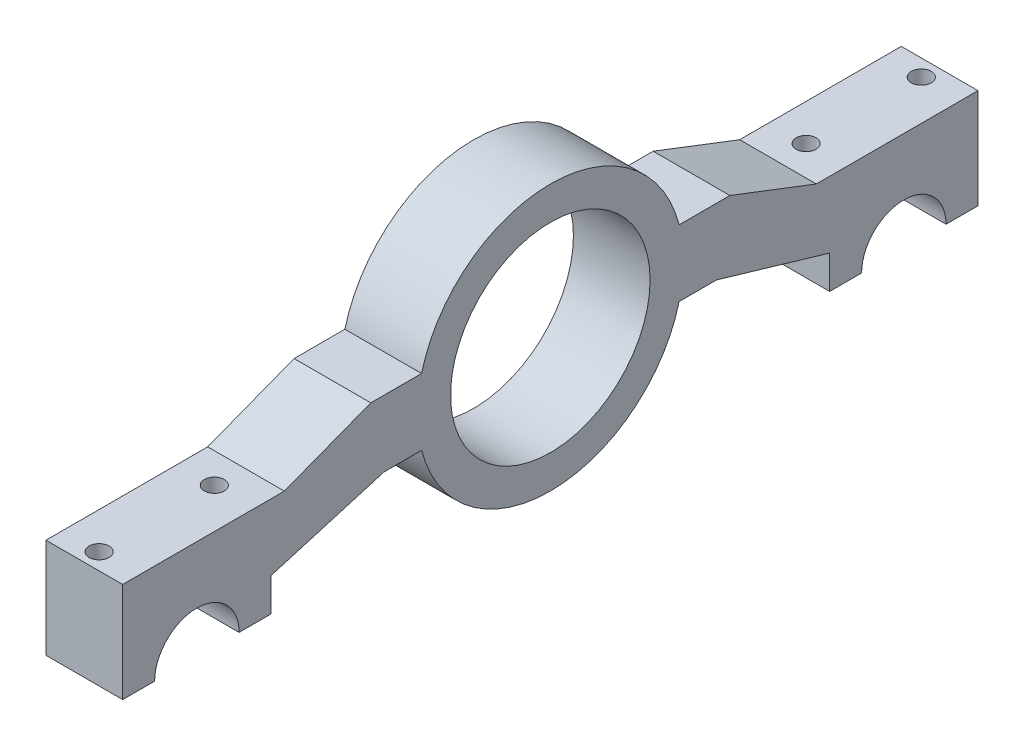
ISO-10303-21;
HEADER;
FILE_DESCRIPTION(('STEP AP214'),'2;1');
FILE_NAME('part.step','',(''),(''),'','','');
FILE_SCHEMA(('AUTOMOTIVE_DESIGN { 1 0 10303 214 1 1 1 1 }'));
ENDSEC;
DATA;
#1=APPLICATION_CONTEXT('core data for automotive mechanical design processes');
#2=APPLICATION_PROTOCOL_DEFINITION('international standard','automotive_design',2000,#1);
#3=PRODUCT_CONTEXT('',#1,'mechanical');
#4=PRODUCT('Part','Part','',(#3));
#5=PRODUCT_RELATED_PRODUCT_CATEGORY('part','',(#4));
#6=PRODUCT_DEFINITION_FORMATION('','',#4);
#7=PRODUCT_DEFINITION_CONTEXT('part definition',#1,'design');
#8=PRODUCT_DEFINITION('design','',#6,#7);
#9=PRODUCT_DEFINITION_SHAPE('','',#8);
#10=(LENGTH_UNIT() NAMED_UNIT(*) SI_UNIT(.MILLI.,.METRE.));
#11=(NAMED_UNIT(*) PLANE_ANGLE_UNIT() SI_UNIT($,.RADIAN.));
#12=(NAMED_UNIT(*) SI_UNIT($,.STERADIAN.) SOLID_ANGLE_UNIT());
#13=UNCERTAINTY_MEASURE_WITH_UNIT(LENGTH_MEASURE(1.E-05),#10,'distance_accuracy_value','');
#14=(GEOMETRIC_REPRESENTATION_CONTEXT(3) GLOBAL_UNCERTAINTY_ASSIGNED_CONTEXT((#13)) GLOBAL_UNIT_ASSIGNED_CONTEXT((#10,
#11,#12)) REPRESENTATION_CONTEXT('',''));
#15=CARTESIAN_POINT('',(0.,0.,0.));
#16=DIRECTION('',(0.,0.,1.));
#17=DIRECTION('',(1.,0.,0.));
#18=AXIS2_PLACEMENT_3D('',#15,#16,#17);
#19=CARTESIAN_POINT('',(-5.765,10.,-48.155));
#20=DIRECTION('',(0.,1.,0.));
#21=DIRECTION('',(-1.,0.,0.));
#22=AXIS2_PLACEMENT_3D('',#19,#20,#21);
#23=PLANE('',#22);
#24=DIRECTION('',(0.,0.,1.));
#25=VECTOR('',#24,1.);
#26=CARTESIAN_POINT('',(-5.765,10.,-48.155));
#27=LINE('',#26,#25);
#28=CARTESIAN_POINT('',(-5.765,10.,24.3649167310371));
#29=VERTEX_POINT('',#28);
#30=CARTESIAN_POINT('',(-5.765,10.,30.));
#31=VERTEX_POINT('',#30);
#32=EDGE_CURVE('E351',#29,#31,#27,.T.);
#33=ORIENTED_EDGE('',*,*,#32,.F.);
#34=DIRECTION('',(1.,0.,0.));
#35=VECTOR('',#34,1.);
#36=CARTESIAN_POINT('',(-5.765,10.,24.3649167310371));
#37=LINE('',#36,#35);
#38=CARTESIAN_POINT('',(5.765,10.,24.3649167310371));
#39=VERTEX_POINT('',#38);
#40=EDGE_CURVE('E57',#29,#39,#37,.T.);
#41=ORIENTED_EDGE('',*,*,#40,.T.);
#42=DIRECTION('',(0.,0.,1.));
#43=VECTOR('',#42,1.);
#44=CARTESIAN_POINT('',(5.765,10.,-48.155));
#45=LINE('',#44,#43);
#46=CARTESIAN_POINT('',(5.765,10.,30.));
#47=VERTEX_POINT('',#46);
#48=EDGE_CURVE('E223',#39,#47,#45,.T.);
#49=ORIENTED_EDGE('',*,*,#48,.T.);
#50=DIRECTION('',(1.,0.,0.));
#51=VECTOR('',#50,1.);
#52=CARTESIAN_POINT('',(-5.765,10.,30.));
#53=LINE('',#52,#51);
#54=EDGE_CURVE('E368',#31,#47,#53,.T.);
#55=ORIENTED_EDGE('',*,*,#54,.F.);
#56=EDGE_LOOP('',(#33,#41,#49,#55));
#57=FACE_BOUND('',#56,.T.);
#58=ADVANCED_FACE('F41',(#57),#23,.F.);
#59=CARTESIAN_POINT('',(0.,20.,0.));
#60=DIRECTION('',(0.,1.,0.));
#61=DIRECTION('',(0.,0.,1.));
#62=AXIS2_PLACEMENT_3D('',#59,#60,#61);
#63=PLANE('',#62);
#64=DIRECTION('',(1.,0.,0.));
#65=VECTOR('',#64,1.);
#66=CARTESIAN_POINT('',(-5.765,20.,24.3649167310371));
#67=LINE('',#66,#65);
#68=CARTESIAN_POINT('',(-5.765,20.,24.3649167310371));
#69=VERTEX_POINT('',#68);
#70=CARTESIAN_POINT('',(5.765,20.,24.3649167310371));
#71=VERTEX_POINT('',#70);
#72=EDGE_CURVE('E11',#69,#71,#67,.T.);
#73=ORIENTED_EDGE('',*,*,#72,.F.);
#74=DIRECTION('',(0.,0.,1.));
#75=VECTOR('',#74,1.);
#76=CARTESIAN_POINT('',(-5.765,20.,0.));
#77=LINE('',#76,#75);
#78=CARTESIAN_POINT('',(-5.765,20.,32.));
#79=VERTEX_POINT('',#78);
#80=EDGE_CURVE('E222',#69,#79,#77,.T.);
#81=ORIENTED_EDGE('',*,*,#80,.T.);
#82=DIRECTION('',(1.,0.,0.));
#83=VECTOR('',#82,1.);
#84=CARTESIAN_POINT('',(-5.765,20.,32.));
#85=LINE('',#84,#83);
#86=CARTESIAN_POINT('',(5.765,20.,32.));
#87=VERTEX_POINT('',#86);
#88=EDGE_CURVE('E241',#79,#87,#85,.T.);
#89=ORIENTED_EDGE('',*,*,#88,.T.);
#90=DIRECTION('',(0.,0.,-1.));
#91=VECTOR('',#90,1.);
#92=CARTESIAN_POINT('',(5.765,20.,0.));
#93=LINE('',#92,#91);
#94=EDGE_CURVE('E218',#87,#71,#93,.T.);
#95=ORIENTED_EDGE('',*,*,#94,.T.);
#96=EDGE_LOOP('',(#73,#81,#89,#95));
#97=FACE_BOUND('',#96,.T.);
#98=ADVANCED_FACE('F493',(#97),#63,.T.);
#99=CARTESIAN_POINT('',(5.765,0.,-59.31));
#100=DIRECTION('',(0.,0.,1.));
#101=DIRECTION('',(1.,0.,0.));
#102=AXIS2_PLACEMENT_3D('',#99,#100,#101);
#103=PLANE('',#102);
#104=DIRECTION('',(1.,0.,0.));
#105=VECTOR('',#104,1.);
#106=CARTESIAN_POINT('',(-5.765,15.,-59.31));
#107=LINE('',#106,#105);
#108=CARTESIAN_POINT('',(-5.765,15.,-59.31));
#109=VERTEX_POINT('',#108);
#110=CARTESIAN_POINT('',(5.765,15.,-59.31));
#111=VERTEX_POINT('',#110);
#112=EDGE_CURVE('E404',#109,#111,#107,.T.);
#113=ORIENTED_EDGE('',*,*,#112,.T.);
#114=DIRECTION('',(0.,1.,0.));
#115=VECTOR('',#114,1.);
#116=CARTESIAN_POINT('',(5.765,0.,-59.31));
#117=LINE('',#116,#115);
#118=CARTESIAN_POINT('',(5.765,0.,-59.31));
#119=VERTEX_POINT('',#118);
#120=EDGE_CURVE('E331',#119,#111,#117,.T.);
#121=ORIENTED_EDGE('',*,*,#120,.F.);
#122=DIRECTION('',(-1.,0.,0.));
#123=VECTOR('',#122,1.);
#124=CARTESIAN_POINT('',(5.765,0.,-59.31));
#125=LINE('',#124,#123);
#126=CARTESIAN_POINT('',(-5.765,0.,-59.31));
#127=VERTEX_POINT('',#126);
#128=EDGE_CURVE('E348',#119,#127,#125,.T.);
#129=ORIENTED_EDGE('',*,*,#128,.T.);
#130=DIRECTION('',(0.,1.,0.));
#131=VECTOR('',#130,1.);
#132=CARTESIAN_POINT('',(-5.765,0.,-59.31));
#133=LINE('',#132,#131);
#134=EDGE_CURVE('E327',#127,#109,#133,.T.);
#135=ORIENTED_EDGE('',*,*,#134,.T.);
#136=EDGE_LOOP('',(#113,#121,#129,#135));
#137=FACE_BOUND('',#136,.T.);
#138=ADVANCED_FACE('F491',(#137),#103,.F.);
#139=CARTESIAN_POINT('',(-5.765,10.,10.));
#140=DIRECTION('',(1.,0.,0.));
#141=DIRECTION('',(0.,0.,-1.));
#142=AXIS2_PLACEMENT_3D('',#139,#140,#141);
#143=PLANE('',#142);
#144=CARTESIAN_POINT('',(-5.765,10.,-20.));
#145=VERTEX_POINT('',#144);
#146=CARTESIAN_POINT('',(-5.765,10.,-14.3649167310371));
#147=VERTEX_POINT('',#146);
#148=EDGE_CURVE('E352',#145,#147,#27,.T.);
#149=ORIENTED_EDGE('',*,*,#148,.T.);
#150=CARTESIAN_POINT('',(-5.765,15.,5.));
#151=DIRECTION('',(1.,0.,0.));
#152=DIRECTION('',(0.,0.,-1.));
#153=AXIS2_PLACEMENT_3D('',#150,#151,#152);
#154=CIRCLE('',#153,20.);
#155=EDGE_CURVE('E199',#29,#147,#154,.T.);
#156=ORIENTED_EDGE('',*,*,#155,.F.);
#157=ORIENTED_EDGE('',*,*,#32,.T.);
#158=DIRECTION('',(0.,0.28216632399155,-0.959365501571271));
#159=VECTOR('',#158,1.);
#160=CARTESIAN_POINT('',(-5.765,17.3248407643312,5.09554140127388));
#161=LINE('',#160,#159);
#162=CARTESIAN_POINT('',(-5.765,4.99999999999999,47.));
#163=VERTEX_POINT('',#162);
#164=EDGE_CURVE('E366',#163,#31,#161,.T.);
#165=ORIENTED_EDGE('',*,*,#164,.F.);
#166=DIRECTION('',(0.,-1.,0.));
#167=VECTOR('',#166,1.);
#168=CARTESIAN_POINT('',(-5.765,0.,47.));
#169=LINE('',#168,#167);
#170=CARTESIAN_POINT('',(-5.765,0.,47.));
#171=VERTEX_POINT('',#170);
#172=EDGE_CURVE('E307',#163,#171,#169,.T.);
#173=ORIENTED_EDGE('',*,*,#172,.T.);
#174=DIRECTION('',(0.,0.,-1.));
#175=VECTOR('',#174,1.);
#176=CARTESIAN_POINT('',(-5.765,0.,-41.805));
#177=LINE('',#176,#175);
#178=CARTESIAN_POINT('',(-5.765,0.,51.805));
#179=VERTEX_POINT('',#178);
#180=EDGE_CURVE('E287',#179,#171,#177,.T.);
#181=ORIENTED_EDGE('',*,*,#180,.F.);
#182=CARTESIAN_POINT('',(-5.765,0.,58.155));
#183=DIRECTION('',(-1.,0.,0.));
#184=DIRECTION('',(0.,0.,1.));
#185=AXIS2_PLACEMENT_3D('',#182,#183,#184);
#186=CIRCLE('',#185,6.35);
#187=CARTESIAN_POINT('',(-5.765,0.,64.505));
#188=VERTEX_POINT('',#187);
#189=EDGE_CURVE('E313',#188,#179,#186,.T.);
#190=ORIENTED_EDGE('',*,*,#189,.F.);
#191=CARTESIAN_POINT('',(-5.765,0.,69.31));
#192=VERTEX_POINT('',#191);
#193=EDGE_CURVE('E284',#192,#188,#177,.T.);
#194=ORIENTED_EDGE('',*,*,#193,.F.);
#195=DIRECTION('',(0.,1.,0.));
#196=VECTOR('',#195,1.);
#197=CARTESIAN_POINT('',(-5.765,0.,69.31));
#198=LINE('',#197,#196);
#199=CARTESIAN_POINT('',(-5.765,15.,69.31));
#200=VERTEX_POINT('',#199);
#201=EDGE_CURVE('E303',#192,#200,#198,.T.);
#202=ORIENTED_EDGE('',*,*,#201,.T.);
#203=DIRECTION('',(0.,0.,-1.));
#204=VECTOR('',#203,1.);
#205=CARTESIAN_POINT('',(-5.765,15.,0.));
#206=LINE('',#205,#204);
#207=CARTESIAN_POINT('',(-5.765,15.,45.));
#208=VERTEX_POINT('',#207);
#209=EDGE_CURVE('E390',#200,#208,#206,.T.);
#210=ORIENTED_EDGE('',*,*,#209,.T.);
#211=DIRECTION('',(0.,0.358979079308869,-0.93334560620306));
#212=VECTOR('',#211,1.);
#213=CARTESIAN_POINT('',(-5.765,28.1443298969072,10.8247422680412));
#214=LINE('',#213,#212);
#215=EDGE_CURVE('E394',#208,#79,#214,.T.);
#216=ORIENTED_EDGE('',*,*,#215,.T.);
#217=ORIENTED_EDGE('',*,*,#80,.F.);
#218=CARTESIAN_POINT('',(-5.765,20.,-14.3649167310371));
#219=VERTEX_POINT('',#218);
#220=EDGE_CURVE('E438',#219,#69,#154,.T.);
#221=ORIENTED_EDGE('',*,*,#220,.F.);
#222=CARTESIAN_POINT('',(-5.765,20.,-22.));
#223=VERTEX_POINT('',#222);
#224=EDGE_CURVE('E209',#223,#219,#77,.T.);
#225=ORIENTED_EDGE('',*,*,#224,.F.);
#226=DIRECTION('',(0.,-0.358979079308869,-0.93334560620306));
#227=VECTOR('',#226,1.);
#228=CARTESIAN_POINT('',(-5.765,24.7938144329897,-9.53608247422681));
#229=LINE('',#228,#227);
#230=CARTESIAN_POINT('',(-5.765,15.,-35.));
#231=VERTEX_POINT('',#230);
#232=EDGE_CURVE('E415',#223,#231,#229,.T.);
#233=ORIENTED_EDGE('',*,*,#232,.T.);
#234=DIRECTION('',(0.,0.,1.));
#235=VECTOR('',#234,1.);
#236=CARTESIAN_POINT('',(-5.765,15.,0.));
#237=LINE('',#236,#235);
#238=EDGE_CURVE('E419',#109,#231,#237,.T.);
#239=ORIENTED_EDGE('',*,*,#238,.F.);
#240=ORIENTED_EDGE('',*,*,#134,.F.);
#241=CARTESIAN_POINT('',(-5.765,0.,-54.505));
#242=VERTEX_POINT('',#241);
#243=EDGE_CURVE('E265',#242,#127,#177,.T.);
#244=ORIENTED_EDGE('',*,*,#243,.F.);
#245=CARTESIAN_POINT('',(-5.765,0.,-48.155));
#246=DIRECTION('',(1.,0.,0.));
#247=DIRECTION('',(0.,0.,-1.));
#248=AXIS2_PLACEMENT_3D('',#245,#246,#247);
#249=CIRCLE('',#248,6.35);
#250=CARTESIAN_POINT('',(-5.765,0.,-41.805));
#251=VERTEX_POINT('',#250);
#252=EDGE_CURVE('E319',#242,#251,#249,.T.);
#253=ORIENTED_EDGE('',*,*,#252,.T.);
#254=CARTESIAN_POINT('',(-5.765,0.,-37.));
#255=VERTEX_POINT('',#254);
#256=EDGE_CURVE('E544',#255,#251,#177,.T.);
#257=ORIENTED_EDGE('',*,*,#256,.F.);
#258=DIRECTION('',(0.,-1.,0.));
#259=VECTOR('',#258,1.);
#260=CARTESIAN_POINT('',(-5.765,0.,-37.));
#261=LINE('',#260,#259);
#262=CARTESIAN_POINT('',(-5.765,5.,-37.));
#263=VERTEX_POINT('',#262);
#264=EDGE_CURVE('E336',#263,#255,#261,.T.);
#265=ORIENTED_EDGE('',*,*,#264,.F.);
#266=DIRECTION('',(0.,-0.282166323991551,-0.95936550157127));
#267=VECTOR('',#266,1.);
#268=CARTESIAN_POINT('',(-5.765,14.6178343949045,-4.29936305732485));
#269=LINE('',#268,#267);
#270=EDGE_CURVE('E452',#145,#263,#269,.T.);
#271=ORIENTED_EDGE('',*,*,#270,.F.);
#272=EDGE_LOOP('',(#149,#156,#157,#165,#173,#181,#190,#194,#202,#210,#216,#217,#221,#225,#233,
#239,#240,#244,#253,#257,#265,#271));
#273=FACE_BOUND('',#272,.T.);
#274=CARTESIAN_POINT('',(-5.765,15.,5.));
#275=DIRECTION('',(1.,0.,0.));
#276=DIRECTION('',(0.,0.,-1.));
#277=AXIS2_PLACEMENT_3D('',#274,#275,#276);
#278=CIRCLE('',#277,15.);
#279=CARTESIAN_POINT('',(-5.765,15.,-10.));
#280=VERTEX_POINT('',#279);
#281=EDGE_CURVE('E472',#280,#280,#278,.T.);
#282=ORIENTED_EDGE('',*,*,#281,.T.);
#283=EDGE_LOOP('',(#282));
#284=FACE_BOUND('',#283,.T.);
#285=ADVANCED_FACE('F363',(#273,#284),#143,.F.);
#286=CARTESIAN_POINT('',(5.765,10.,10.));
#287=DIRECTION('',(-1.,0.,0.));
#288=DIRECTION('',(0.,0.,1.));
#289=AXIS2_PLACEMENT_3D('',#286,#287,#288);
#290=PLANE('',#289);
#291=ORIENTED_EDGE('',*,*,#48,.F.);
#292=CARTESIAN_POINT('',(5.765,15.,5.));
#293=DIRECTION('',(1.,0.,0.));
#294=DIRECTION('',(0.,0.,-1.));
#295=AXIS2_PLACEMENT_3D('',#292,#293,#294);
#296=CIRCLE('',#295,20.);
#297=CARTESIAN_POINT('',(5.765,10.,-14.3649167310371));
#298=VERTEX_POINT('',#297);
#299=EDGE_CURVE('E200',#39,#298,#296,.T.);
#300=ORIENTED_EDGE('',*,*,#299,.T.);
#301=CARTESIAN_POINT('',(5.765,10.,-20.));
#302=VERTEX_POINT('',#301);
#303=EDGE_CURVE('E65',#302,#298,#45,.T.);
#304=ORIENTED_EDGE('',*,*,#303,.F.);
#305=DIRECTION('',(0.,-0.282166323991551,-0.95936550157127));
#306=VECTOR('',#305,1.);
#307=CARTESIAN_POINT('',(5.765,14.6178343949045,-4.29936305732485));
#308=LINE('',#307,#306);
#309=CARTESIAN_POINT('',(5.765,5.,-37.));
#310=VERTEX_POINT('',#309);
#311=EDGE_CURVE('E451',#302,#310,#308,.T.);
#312=ORIENTED_EDGE('',*,*,#311,.T.);
#313=DIRECTION('',(0.,-1.,0.));
#314=VECTOR('',#313,1.);
#315=CARTESIAN_POINT('',(5.765,0.,-37.));
#316=LINE('',#315,#314);
#317=CARTESIAN_POINT('',(5.765,0.,-37.));
#318=VERTEX_POINT('',#317);
#319=EDGE_CURVE('E335',#310,#318,#316,.T.);
#320=ORIENTED_EDGE('',*,*,#319,.T.);
#321=DIRECTION('',(0.,0.,-1.));
#322=VECTOR('',#321,1.);
#323=CARTESIAN_POINT('',(5.765,0.,-59.31));
#324=LINE('',#323,#322);
#325=CARTESIAN_POINT('',(5.765,0.,-41.805));
#326=VERTEX_POINT('',#325);
#327=EDGE_CURVE('E528',#318,#326,#324,.T.);
#328=ORIENTED_EDGE('',*,*,#327,.T.);
#329=CARTESIAN_POINT('',(5.765,0.,-48.155));
#330=DIRECTION('',(1.,0.,0.));
#331=DIRECTION('',(0.,0.,-1.));
#332=AXIS2_PLACEMENT_3D('',#329,#330,#331);
#333=CIRCLE('',#332,6.35);
#334=CARTESIAN_POINT('',(5.765,0.,-54.505));
#335=VERTEX_POINT('',#334);
#336=EDGE_CURVE('E323',#335,#326,#333,.T.);
#337=ORIENTED_EDGE('',*,*,#336,.F.);
#338=EDGE_CURVE('E283',#335,#119,#324,.T.);
#339=ORIENTED_EDGE('',*,*,#338,.T.);
#340=ORIENTED_EDGE('',*,*,#120,.T.);
#341=DIRECTION('',(0.,0.,1.));
#342=VECTOR('',#341,1.);
#343=CARTESIAN_POINT('',(5.765,15.,0.));
#344=LINE('',#343,#342);
#345=CARTESIAN_POINT('',(5.765,15.,-35.));
#346=VERTEX_POINT('',#345);
#347=EDGE_CURVE('E420',#111,#346,#344,.T.);
#348=ORIENTED_EDGE('',*,*,#347,.T.);
#349=DIRECTION('',(0.,-0.358979079308869,-0.93334560620306));
#350=VECTOR('',#349,1.);
#351=CARTESIAN_POINT('',(5.765,24.7938144329897,-9.53608247422681));
#352=LINE('',#351,#350);
#353=CARTESIAN_POINT('',(5.765,20.,-22.));
#354=VERTEX_POINT('',#353);
#355=EDGE_CURVE('E216',#354,#346,#352,.T.);
#356=ORIENTED_EDGE('',*,*,#355,.F.);
#357=CARTESIAN_POINT('',(5.765,20.,-14.3649167310371));
#358=VERTEX_POINT('',#357);
#359=EDGE_CURVE('E206',#358,#354,#93,.T.);
#360=ORIENTED_EDGE('',*,*,#359,.F.);
#361=EDGE_CURVE('E189',#358,#71,#296,.T.);
#362=ORIENTED_EDGE('',*,*,#361,.T.);
#363=ORIENTED_EDGE('',*,*,#94,.F.);
#364=DIRECTION('',(0.,0.358979079308869,-0.93334560620306));
#365=VECTOR('',#364,1.);
#366=CARTESIAN_POINT('',(5.765,28.1443298969072,10.8247422680412));
#367=LINE('',#366,#365);
#368=CARTESIAN_POINT('',(5.765,15.,45.));
#369=VERTEX_POINT('',#368);
#370=EDGE_CURVE('E395',#369,#87,#367,.T.);
#371=ORIENTED_EDGE('',*,*,#370,.F.);
#372=DIRECTION('',(0.,0.,-1.));
#373=VECTOR('',#372,1.);
#374=CARTESIAN_POINT('',(5.765,15.,0.));
#375=LINE('',#374,#373);
#376=CARTESIAN_POINT('',(5.765,15.,69.31));
#377=VERTEX_POINT('',#376);
#378=EDGE_CURVE('E400',#377,#369,#375,.T.);
#379=ORIENTED_EDGE('',*,*,#378,.F.);
#380=DIRECTION('',(0.,1.,0.));
#381=VECTOR('',#380,1.);
#382=CARTESIAN_POINT('',(5.765,0.,69.31));
#383=LINE('',#382,#381);
#384=CARTESIAN_POINT('',(5.765,0.,69.31));
#385=VERTEX_POINT('',#384);
#386=EDGE_CURVE('E298',#385,#377,#383,.T.);
#387=ORIENTED_EDGE('',*,*,#386,.F.);
#388=CARTESIAN_POINT('',(5.765,0.,64.505));
#389=VERTEX_POINT('',#388);
#390=EDGE_CURVE('E277',#385,#389,#324,.T.);
#391=ORIENTED_EDGE('',*,*,#390,.T.);
#392=CARTESIAN_POINT('',(5.765,0.,58.155));
#393=DIRECTION('',(-1.,0.,0.));
#394=DIRECTION('',(0.,0.,1.));
#395=AXIS2_PLACEMENT_3D('',#392,#393,#394);
#396=CIRCLE('',#395,6.35);
#397=CARTESIAN_POINT('',(5.765,0.,51.805));
#398=VERTEX_POINT('',#397);
#399=EDGE_CURVE('E293',#389,#398,#396,.T.);
#400=ORIENTED_EDGE('',*,*,#399,.T.);
#401=CARTESIAN_POINT('',(5.765,0.,47.));
#402=VERTEX_POINT('',#401);
#403=EDGE_CURVE('E282',#398,#402,#324,.T.);
#404=ORIENTED_EDGE('',*,*,#403,.T.);
#405=DIRECTION('',(0.,-1.,0.));
#406=VECTOR('',#405,1.);
#407=CARTESIAN_POINT('',(5.765,0.,47.));
#408=LINE('',#407,#406);
#409=CARTESIAN_POINT('',(5.765,4.99999999999999,47.));
#410=VERTEX_POINT('',#409);
#411=EDGE_CURVE('E299',#410,#402,#408,.T.);
#412=ORIENTED_EDGE('',*,*,#411,.F.);
#413=DIRECTION('',(0.,0.28216632399155,-0.959365501571271));
#414=VECTOR('',#413,1.);
#415=CARTESIAN_POINT('',(5.765,17.3248407643312,5.09554140127388));
#416=LINE('',#415,#414);
#417=EDGE_CURVE('E379',#410,#47,#416,.T.);
#418=ORIENTED_EDGE('',*,*,#417,.T.);
#419=EDGE_LOOP('',(#291,#300,#304,#312,#320,#328,#337,#339,#340,#348,#356,#360,#362,#363,#371,
#379,#387,#391,#400,#404,#412,#418));
#420=FACE_BOUND('',#419,.T.);
#421=CARTESIAN_POINT('',(5.765,15.,5.));
#422=DIRECTION('',(1.,0.,0.));
#423=DIRECTION('',(0.,0.,-1.));
#424=AXIS2_PLACEMENT_3D('',#421,#422,#423);
#425=CIRCLE('',#424,15.);
#426=CARTESIAN_POINT('',(5.765,15.,-10.));
#427=VERTEX_POINT('',#426);
#428=EDGE_CURVE('E446',#427,#427,#425,.T.);
#429=ORIENTED_EDGE('',*,*,#428,.F.);
#430=EDGE_LOOP('',(#429));
#431=FACE_BOUND('',#430,.T.);
#432=ADVANCED_FACE('F43',(#420,#431),#290,.F.);
#433=CARTESIAN_POINT('',(-0.265,20.,-39.5));
#434=DIRECTION('',(0.,-1.,0.));
#435=DIRECTION('',(0.,0.,-1.));
#436=AXIS2_PLACEMENT_3D('',#433,#434,#435);
#437=CYLINDRICAL_SURFACE('',#436,1.5);
#438=CARTESIAN_POINT('',(-0.265,0.,-39.5));
#439=DIRECTION('',(0.,-1.,0.));
#440=DIRECTION('',(0.,0.,-1.));
#441=AXIS2_PLACEMENT_3D('',#438,#439,#440);
#442=CIRCLE('',#441,1.5);
#443=CARTESIAN_POINT('',(-0.265,0.,-41.));
#444=VERTEX_POINT('',#443);
#445=EDGE_CURVE('E266',#444,#444,#442,.T.);
#446=ORIENTED_EDGE('',*,*,#445,.T.);
#447=EDGE_LOOP('',(#446));
#448=FACE_BOUND('',#447,.T.);
#449=CARTESIAN_POINT('',(-0.265,15.,-39.5));
#450=DIRECTION('',(0.,1.,0.));
#451=DIRECTION('',(0.,0.,1.));
#452=AXIS2_PLACEMENT_3D('',#449,#450,#451);
#453=CIRCLE('',#452,1.5);
#454=CARTESIAN_POINT('',(-0.265,15.,-38.));
#455=VERTEX_POINT('',#454);
#456=EDGE_CURVE('E245',#455,#455,#453,.F.);
#457=ORIENTED_EDGE('',*,*,#456,.F.);
#458=EDGE_LOOP('',(#457));
#459=FACE_BOUND('',#458,.T.);
#460=ADVANCED_FACE('F483',(#448,#459),#437,.F.);
#461=CARTESIAN_POINT('',(-0.265,20.,-56.81));
#462=DIRECTION('',(0.,-1.,0.));
#463=DIRECTION('',(0.,0.,-1.));
#464=AXIS2_PLACEMENT_3D('',#461,#462,#463);
#465=CYLINDRICAL_SURFACE('',#464,1.5);
#466=CARTESIAN_POINT('',(-0.265,0.,-56.81));
#467=DIRECTION('',(0.,-1.,0.));
#468=DIRECTION('',(0.,0.,-1.));
#469=AXIS2_PLACEMENT_3D('',#466,#467,#468);
#470=CIRCLE('',#469,1.5);
#471=CARTESIAN_POINT('',(-0.265,0.,-58.31));
#472=VERTEX_POINT('',#471);
#473=EDGE_CURVE('E261',#472,#472,#470,.T.);
#474=ORIENTED_EDGE('',*,*,#473,.T.);
#475=EDGE_LOOP('',(#474));
#476=FACE_BOUND('',#475,.T.);
#477=CARTESIAN_POINT('',(-0.265,15.,-56.81));
#478=DIRECTION('',(0.,1.,0.));
#479=DIRECTION('',(0.,0.,1.));
#480=AXIS2_PLACEMENT_3D('',#477,#478,#479);
#481=CIRCLE('',#480,1.5);
#482=CARTESIAN_POINT('',(-0.265,15.,-55.31));
#483=VERTEX_POINT('',#482);
#484=EDGE_CURVE('E242',#483,#483,#481,.F.);
#485=ORIENTED_EDGE('',*,*,#484,.F.);
#486=EDGE_LOOP('',(#485));
#487=FACE_BOUND('',#486,.T.);
#488=ADVANCED_FACE('F488',(#476,#487),#465,.F.);
#489=CARTESIAN_POINT('',(5.765,0.,-48.155));
#490=DIRECTION('',(-1.,0.,0.));
#491=DIRECTION('',(0.,0.,1.));
#492=AXIS2_PLACEMENT_3D('',#489,#490,#491);
#493=CYLINDRICAL_SURFACE('',#492,6.35);
#494=DIRECTION('',(-1.,0.,0.));
#495=VECTOR('',#494,1.);
#496=CARTESIAN_POINT('',(5.765,0.,-54.505));
#497=LINE('',#496,#495);
#498=EDGE_CURVE('E290',#335,#242,#497,.T.);
#499=ORIENTED_EDGE('',*,*,#498,.F.);
#500=ORIENTED_EDGE('',*,*,#336,.T.);
#501=DIRECTION('',(-1.,0.,0.));
#502=VECTOR('',#501,1.);
#503=CARTESIAN_POINT('',(5.765,0.,-41.805));
#504=LINE('',#503,#502);
#505=EDGE_CURVE('E281',#251,#326,#504,.F.);
#506=ORIENTED_EDGE('',*,*,#505,.F.);
#507=ORIENTED_EDGE('',*,*,#252,.F.);
#508=EDGE_LOOP('',(#499,#500,#506,#507));
#509=FACE_BOUND('',#508,.T.);
#510=ADVANCED_FACE('F508',(#509),#493,.F.);
#511=CARTESIAN_POINT('',(5.765,0.,-37.));
#512=DIRECTION('',(0.,0.,-1.));
#513=DIRECTION('',(-1.,0.,0.));
#514=AXIS2_PLACEMENT_3D('',#511,#512,#513);
#515=PLANE('',#514);
#516=ORIENTED_EDGE('',*,*,#319,.F.);
#517=DIRECTION('',(1.,0.,0.));
#518=VECTOR('',#517,1.);
#519=CARTESIAN_POINT('',(-5.765,5.,-37.));
#520=LINE('',#519,#518);
#521=EDGE_CURVE('E384',#263,#310,#520,.T.);
#522=ORIENTED_EDGE('',*,*,#521,.F.);
#523=ORIENTED_EDGE('',*,*,#264,.T.);
#524=DIRECTION('',(-1.,0.,0.));
#525=VECTOR('',#524,1.);
#526=CARTESIAN_POINT('',(5.765,0.,-37.));
#527=LINE('',#526,#525);
#528=EDGE_CURVE('E339',#318,#255,#527,.T.);
#529=ORIENTED_EDGE('',*,*,#528,.F.);
#530=EDGE_LOOP('',(#516,#522,#523,#529));
#531=FACE_BOUND('',#530,.T.);
#532=ADVANCED_FACE('F502',(#531),#515,.F.);
#533=ORIENTED_EDGE('',*,*,#303,.T.);
#534=DIRECTION('',(1.,0.,0.));
#535=VECTOR('',#534,1.);
#536=CARTESIAN_POINT('',(-5.765,10.,-14.3649167310371));
#537=LINE('',#536,#535);
#538=EDGE_CURVE('E440',#298,#147,#537,.F.);
#539=ORIENTED_EDGE('',*,*,#538,.T.);
#540=ORIENTED_EDGE('',*,*,#148,.F.);
#541=DIRECTION('',(1.,0.,0.));
#542=VECTOR('',#541,1.);
#543=CARTESIAN_POINT('',(-5.765,10.,-20.));
#544=LINE('',#543,#542);
#545=EDGE_CURVE('E387',#145,#302,#544,.T.);
#546=ORIENTED_EDGE('',*,*,#545,.T.);
#547=EDGE_LOOP('',(#533,#539,#540,#546));
#548=FACE_BOUND('',#547,.T.);
#549=ADVANCED_FACE('F464',(#548),#23,.F.);
#550=DIRECTION('',(1.,0.,0.));
#551=VECTOR('',#550,1.);
#552=CARTESIAN_POINT('',(-5.765,20.,-14.3649167310371));
#553=LINE('',#552,#551);
#554=EDGE_CURVE('E50',#358,#219,#553,.F.);
#555=ORIENTED_EDGE('',*,*,#554,.F.);
#556=ORIENTED_EDGE('',*,*,#359,.T.);
#557=DIRECTION('',(1.,0.,0.));
#558=VECTOR('',#557,1.);
#559=CARTESIAN_POINT('',(-5.765,20.,-22.));
#560=LINE('',#559,#558);
#561=EDGE_CURVE('E258',#223,#354,#560,.T.);
#562=ORIENTED_EDGE('',*,*,#561,.F.);
#563=ORIENTED_EDGE('',*,*,#224,.T.);
#564=EDGE_LOOP('',(#555,#556,#562,#563));
#565=FACE_BOUND('',#564,.T.);
#566=ADVANCED_FACE('F204',(#565),#63,.T.);
#567=CARTESIAN_POINT('',(5.765,0.,47.));
#568=DIRECTION('',(0.,0.,-1.));
#569=DIRECTION('',(-1.,0.,0.));
#570=AXIS2_PLACEMENT_3D('',#567,#568,#569);
#571=PLANE('',#570);
#572=DIRECTION('',(1.,0.,0.));
#573=VECTOR('',#572,1.);
#574=CARTESIAN_POINT('',(-5.765,4.99999999999999,47.));
#575=LINE('',#574,#573);
#576=EDGE_CURVE('E373',#163,#410,#575,.T.);
#577=ORIENTED_EDGE('',*,*,#576,.T.);
#578=ORIENTED_EDGE('',*,*,#411,.T.);
#579=DIRECTION('',(-1.,0.,0.));
#580=VECTOR('',#579,1.);
#581=CARTESIAN_POINT('',(5.765,0.,47.));
#582=LINE('',#581,#580);
#583=EDGE_CURVE('E294',#402,#171,#582,.T.);
#584=ORIENTED_EDGE('',*,*,#583,.T.);
#585=ORIENTED_EDGE('',*,*,#172,.F.);
#586=EDGE_LOOP('',(#577,#578,#584,#585));
#587=FACE_BOUND('',#586,.T.);
#588=ADVANCED_FACE('F507',(#587),#571,.T.);
#589=CARTESIAN_POINT('',(5.765,0.,69.31));
#590=DIRECTION('',(0.,0.,1.));
#591=DIRECTION('',(1.,0.,0.));
#592=AXIS2_PLACEMENT_3D('',#589,#590,#591);
#593=PLANE('',#592);
#594=DIRECTION('',(1.,0.,0.));
#595=VECTOR('',#594,1.);
#596=CARTESIAN_POINT('',(-5.765,15.,69.31));
#597=LINE('',#596,#595);
#598=EDGE_CURVE('E399',#200,#377,#597,.T.);
#599=ORIENTED_EDGE('',*,*,#598,.F.);
#600=ORIENTED_EDGE('',*,*,#201,.F.);
#601=DIRECTION('',(-1.,0.,0.));
#602=VECTOR('',#601,1.);
#603=CARTESIAN_POINT('',(5.765,0.,69.31));
#604=LINE('',#603,#602);
#605=EDGE_CURVE('E300',#385,#192,#604,.T.);
#606=ORIENTED_EDGE('',*,*,#605,.F.);
#607=ORIENTED_EDGE('',*,*,#386,.T.);
#608=EDGE_LOOP('',(#599,#600,#606,#607));
#609=FACE_BOUND('',#608,.T.);
#610=ADVANCED_FACE('F587',(#609),#593,.T.);
#611=CARTESIAN_POINT('',(5.765,0.,58.155));
#612=DIRECTION('',(-1.,0.,0.));
#613=DIRECTION('',(0.,0.,1.));
#614=AXIS2_PLACEMENT_3D('',#611,#612,#613);
#615=CYLINDRICAL_SURFACE('',#614,6.35);
#616=ORIENTED_EDGE('',*,*,#189,.T.);
#617=DIRECTION('',(-1.,0.,0.));
#618=VECTOR('',#617,1.);
#619=CARTESIAN_POINT('',(5.765,0.,51.805));
#620=LINE('',#619,#618);
#621=EDGE_CURVE('E211',#179,#398,#620,.F.);
#622=ORIENTED_EDGE('',*,*,#621,.T.);
#623=ORIENTED_EDGE('',*,*,#399,.F.);
#624=DIRECTION('',(-1.,0.,0.));
#625=VECTOR('',#624,1.);
#626=CARTESIAN_POINT('',(5.765,0.,64.505));
#627=LINE('',#626,#625);
#628=EDGE_CURVE('E229',#389,#188,#627,.T.);
#629=ORIENTED_EDGE('',*,*,#628,.T.);
#630=EDGE_LOOP('',(#616,#622,#623,#629));
#631=FACE_BOUND('',#630,.T.);
#632=ADVANCED_FACE('F539',(#631),#615,.F.);
#633=CARTESIAN_POINT('',(5.765,0.,-41.805));
#634=DIRECTION('',(0.,1.,0.));
#635=DIRECTION('',(0.,0.,1.));
#636=AXIS2_PLACEMENT_3D('',#633,#634,#635);
#637=PLANE('',#636);
#638=CARTESIAN_POINT('',(-0.265,0.,66.8240846756175));
#639=DIRECTION('',(0.,-1.,0.));
#640=DIRECTION('',(0.,0.,-1.));
#641=AXIS2_PLACEMENT_3D('',#638,#639,#640);
#642=CIRCLE('',#641,1.5);
#643=CARTESIAN_POINT('',(-0.265,0.,65.3240846756175));
#644=VERTEX_POINT('',#643);
#645=EDGE_CURVE('E270',#644,#644,#642,.T.);
#646=ORIENTED_EDGE('',*,*,#645,.F.);
#647=EDGE_LOOP('',(#646));
#648=FACE_BOUND('',#647,.T.);
#649=ORIENTED_EDGE('',*,*,#390,.F.);
#650=ORIENTED_EDGE('',*,*,#605,.T.);
#651=ORIENTED_EDGE('',*,*,#193,.T.);
#652=ORIENTED_EDGE('',*,*,#628,.F.);
#653=EDGE_LOOP('',(#649,#650,#651,#652));
#654=FACE_BOUND('',#653,.T.);
#655=ADVANCED_FACE('F584',(#648,#654),#637,.F.);
#656=CARTESIAN_POINT('',(-0.265,0.,49.5));
#657=DIRECTION('',(0.,-1.,0.));
#658=DIRECTION('',(0.,0.,-1.));
#659=AXIS2_PLACEMENT_3D('',#656,#657,#658);
#660=CIRCLE('',#659,1.5);
#661=CARTESIAN_POINT('',(-0.265,0.,48.));
#662=VERTEX_POINT('',#661);
#663=EDGE_CURVE('E251',#662,#662,#660,.T.);
#664=ORIENTED_EDGE('',*,*,#663,.F.);
#665=EDGE_LOOP('',(#664));
#666=FACE_BOUND('',#665,.T.);
#667=ORIENTED_EDGE('',*,*,#583,.F.);
#668=ORIENTED_EDGE('',*,*,#403,.F.);
#669=ORIENTED_EDGE('',*,*,#621,.F.);
#670=ORIENTED_EDGE('',*,*,#180,.T.);
#671=EDGE_LOOP('',(#667,#668,#669,#670));
#672=FACE_BOUND('',#671,.T.);
#673=ADVANCED_FACE('F535',(#666,#672),#637,.F.);
#674=ORIENTED_EDGE('',*,*,#473,.F.);
#675=EDGE_LOOP('',(#674));
#676=FACE_BOUND('',#675,.T.);
#677=ORIENTED_EDGE('',*,*,#498,.T.);
#678=ORIENTED_EDGE('',*,*,#243,.T.);
#679=ORIENTED_EDGE('',*,*,#128,.F.);
#680=ORIENTED_EDGE('',*,*,#338,.F.);
#681=EDGE_LOOP('',(#677,#678,#679,#680));
#682=FACE_BOUND('',#681,.T.);
#683=ADVANCED_FACE('F551',(#676,#682),#637,.F.);
#684=ORIENTED_EDGE('',*,*,#445,.F.);
#685=EDGE_LOOP('',(#684));
#686=FACE_BOUND('',#685,.T.);
#687=ORIENTED_EDGE('',*,*,#505,.T.);
#688=ORIENTED_EDGE('',*,*,#327,.F.);
#689=ORIENTED_EDGE('',*,*,#528,.T.);
#690=ORIENTED_EDGE('',*,*,#256,.T.);
#691=EDGE_LOOP('',(#687,#688,#689,#690));
#692=FACE_BOUND('',#691,.T.);
#693=ADVANCED_FACE('F576',(#686,#692),#637,.F.);
#694=CARTESIAN_POINT('',(-0.265,20.,49.5));
#695=DIRECTION('',(0.,-1.,0.));
#696=DIRECTION('',(0.,0.,-1.));
#697=AXIS2_PLACEMENT_3D('',#694,#695,#696);
#698=CYLINDRICAL_SURFACE('',#697,1.5);
#699=CARTESIAN_POINT('',(-0.265,15.,49.5));
#700=DIRECTION('',(0.,-1.,0.));
#701=DIRECTION('',(0.,0.,-1.));
#702=AXIS2_PLACEMENT_3D('',#699,#700,#701);
#703=CIRCLE('',#702,1.5);
#704=CARTESIAN_POINT('',(-0.265,15.,48.));
#705=VERTEX_POINT('',#704);
#706=EDGE_CURVE('E240',#705,#705,#703,.F.);
#707=ORIENTED_EDGE('',*,*,#706,.T.);
#708=EDGE_LOOP('',(#707));
#709=FACE_BOUND('',#708,.T.);
#710=ORIENTED_EDGE('',*,*,#663,.T.);
#711=EDGE_LOOP('',(#710));
#712=FACE_BOUND('',#711,.T.);
#713=ADVANCED_FACE('F573',(#709,#712),#698,.F.);
#714=CARTESIAN_POINT('',(-0.265,20.,66.8240846756175));
#715=DIRECTION('',(0.,-1.,0.));
#716=DIRECTION('',(0.,0.,-1.));
#717=AXIS2_PLACEMENT_3D('',#714,#715,#716);
#718=CYLINDRICAL_SURFACE('',#717,1.5);
#719=CARTESIAN_POINT('',(-0.265,15.,66.8240846756175));
#720=DIRECTION('',(0.,-1.,0.));
#721=DIRECTION('',(0.,0.,-1.));
#722=AXIS2_PLACEMENT_3D('',#719,#720,#721);
#723=CIRCLE('',#722,1.5);
#724=CARTESIAN_POINT('',(-0.265,15.,65.3240846756175));
#725=VERTEX_POINT('',#724);
#726=EDGE_CURVE('E236',#725,#725,#723,.F.);
#727=ORIENTED_EDGE('',*,*,#726,.T.);
#728=EDGE_LOOP('',(#727));
#729=FACE_BOUND('',#728,.T.);
#730=ORIENTED_EDGE('',*,*,#645,.T.);
#731=EDGE_LOOP('',(#730));
#732=FACE_BOUND('',#731,.T.);
#733=ADVANCED_FACE('F575',(#729,#732),#718,.F.);
#734=CARTESIAN_POINT('',(-5.765,15.,0.));
#735=DIRECTION('',(0.,-1.,0.));
#736=DIRECTION('',(0.,0.,-1.));
#737=AXIS2_PLACEMENT_3D('',#734,#735,#736);
#738=PLANE('',#737);
#739=ORIENTED_EDGE('',*,*,#726,.F.);
#740=EDGE_LOOP('',(#739));
#741=FACE_BOUND('',#740,.T.);
#742=ORIENTED_EDGE('',*,*,#378,.T.);
#743=DIRECTION('',(1.,0.,0.));
#744=VECTOR('',#743,1.);
#745=CARTESIAN_POINT('',(-5.765,15.,45.));
#746=LINE('',#745,#744);
#747=EDGE_CURVE('E410',#208,#369,#746,.T.);
#748=ORIENTED_EDGE('',*,*,#747,.F.);
#749=ORIENTED_EDGE('',*,*,#209,.F.);
#750=ORIENTED_EDGE('',*,*,#598,.T.);
#751=EDGE_LOOP('',(#742,#748,#749,#750));
#752=FACE_BOUND('',#751,.T.);
#753=ORIENTED_EDGE('',*,*,#706,.F.);
#754=EDGE_LOOP('',(#753));
#755=FACE_BOUND('',#754,.T.);
#756=ADVANCED_FACE('F565',(#741,#752,#755),#738,.F.);
#757=CARTESIAN_POINT('',(-5.765,28.1443298969072,10.8247422680412));
#758=DIRECTION('',(0.,-0.933345606203059,-0.358979079308869));
#759=DIRECTION('',(0.,0.358979079308869,-0.93334560620306));
#760=AXIS2_PLACEMENT_3D('',#757,#758,#759);
#761=PLANE('',#760);
#762=ORIENTED_EDGE('',*,*,#370,.T.);
#763=ORIENTED_EDGE('',*,*,#88,.F.);
#764=ORIENTED_EDGE('',*,*,#215,.F.);
#765=ORIENTED_EDGE('',*,*,#747,.T.);
#766=EDGE_LOOP('',(#762,#763,#764,#765));
#767=FACE_BOUND('',#766,.T.);
#768=ADVANCED_FACE('F555',(#767),#761,.F.);
#769=CARTESIAN_POINT('',(-5.765,15.,0.));
#770=DIRECTION('',(0.,1.,0.));
#771=DIRECTION('',(0.,0.,1.));
#772=AXIS2_PLACEMENT_3D('',#769,#770,#771);
#773=PLANE('',#772);
#774=ORIENTED_EDGE('',*,*,#347,.F.);
#775=ORIENTED_EDGE('',*,*,#112,.F.);
#776=ORIENTED_EDGE('',*,*,#238,.T.);
#777=DIRECTION('',(1.,0.,0.));
#778=VECTOR('',#777,1.);
#779=CARTESIAN_POINT('',(-5.765,15.,-35.));
#780=LINE('',#779,#778);
#781=EDGE_CURVE('E429',#231,#346,#780,.T.);
#782=ORIENTED_EDGE('',*,*,#781,.T.);
#783=EDGE_LOOP('',(#774,#775,#776,#782));
#784=FACE_BOUND('',#783,.T.);
#785=ORIENTED_EDGE('',*,*,#484,.T.);
#786=EDGE_LOOP('',(#785));
#787=FACE_BOUND('',#786,.T.);
#788=ORIENTED_EDGE('',*,*,#456,.T.);
#789=EDGE_LOOP('',(#788));
#790=FACE_BOUND('',#789,.T.);
#791=ADVANCED_FACE('F553',(#784,#787,#790),#773,.T.);
#792=CARTESIAN_POINT('',(-5.765,24.7938144329897,-9.53608247422681));
#793=DIRECTION('',(0.,-0.933345606203059,0.358979079308869));
#794=DIRECTION('',(0.,-0.358979079308869,-0.93334560620306));
#795=AXIS2_PLACEMENT_3D('',#792,#793,#794);
#796=PLANE('',#795);
#797=ORIENTED_EDGE('',*,*,#355,.T.);
#798=ORIENTED_EDGE('',*,*,#781,.F.);
#799=ORIENTED_EDGE('',*,*,#232,.F.);
#800=ORIENTED_EDGE('',*,*,#561,.T.);
#801=EDGE_LOOP('',(#797,#798,#799,#800));
#802=FACE_BOUND('',#801,.T.);
#803=ADVANCED_FACE('F435',(#802),#796,.F.);
#804=CARTESIAN_POINT('',(-5.765,17.3248407643312,5.09554140127388));
#805=DIRECTION('',(0.,-0.959365501571271,-0.28216632399155));
#806=DIRECTION('',(0.,0.28216632399155,-0.959365501571271));
#807=AXIS2_PLACEMENT_3D('',#804,#805,#806);
#808=PLANE('',#807);
#809=ORIENTED_EDGE('',*,*,#417,.F.);
#810=ORIENTED_EDGE('',*,*,#576,.F.);
#811=ORIENTED_EDGE('',*,*,#164,.T.);
#812=ORIENTED_EDGE('',*,*,#54,.T.);
#813=EDGE_LOOP('',(#809,#810,#811,#812));
#814=FACE_BOUND('',#813,.T.);
#815=ADVANCED_FACE('F376',(#814),#808,.T.);
#816=CARTESIAN_POINT('',(-5.765,14.6178343949045,-4.29936305732485));
#817=DIRECTION('',(0.,-0.959365501571271,0.282166323991551));
#818=DIRECTION('',(0.,-0.282166323991551,-0.959365501571271));
#819=AXIS2_PLACEMENT_3D('',#816,#817,#818);
#820=PLANE('',#819);
#821=ORIENTED_EDGE('',*,*,#311,.F.);
#822=ORIENTED_EDGE('',*,*,#545,.F.);
#823=ORIENTED_EDGE('',*,*,#270,.T.);
#824=ORIENTED_EDGE('',*,*,#521,.T.);
#825=EDGE_LOOP('',(#821,#822,#823,#824));
#826=FACE_BOUND('',#825,.T.);
#827=ADVANCED_FACE('F465',(#826),#820,.T.);
#828=CARTESIAN_POINT('',(-5.765,15.,5.));
#829=DIRECTION('',(1.,0.,0.));
#830=DIRECTION('',(0.,0.,-1.));
#831=AXIS2_PLACEMENT_3D('',#828,#829,#830);
#832=CYLINDRICAL_SURFACE('',#831,20.);
#833=ORIENTED_EDGE('',*,*,#220,.T.);
#834=ORIENTED_EDGE('',*,*,#72,.T.);
#835=ORIENTED_EDGE('',*,*,#361,.F.);
#836=ORIENTED_EDGE('',*,*,#554,.T.);
#837=EDGE_LOOP('',(#833,#834,#835,#836));
#838=FACE_BOUND('',#837,.T.);
#839=ADVANCED_FACE('F191',(#838),#832,.T.);
#840=ORIENTED_EDGE('',*,*,#40,.F.);
#841=ORIENTED_EDGE('',*,*,#155,.T.);
#842=ORIENTED_EDGE('',*,*,#538,.F.);
#843=ORIENTED_EDGE('',*,*,#299,.F.);
#844=EDGE_LOOP('',(#840,#841,#842,#843));
#845=FACE_BOUND('',#844,.T.);
#846=ADVANCED_FACE('F702',(#845),#832,.T.);
#847=CARTESIAN_POINT('',(-5.765,15.,5.));
#848=DIRECTION('',(1.,0.,0.));
#849=DIRECTION('',(0.,0.,-1.));
#850=AXIS2_PLACEMENT_3D('',#847,#848,#849);
#851=CYLINDRICAL_SURFACE('',#850,15.);
#852=ORIENTED_EDGE('',*,*,#428,.T.);
#853=EDGE_LOOP('',(#852));
#854=FACE_BOUND('',#853,.T.);
#855=ORIENTED_EDGE('',*,*,#281,.F.);
#856=EDGE_LOOP('',(#855));
#857=FACE_BOUND('',#856,.T.);
#858=ADVANCED_FACE('F480',(#854,#857),#851,.F.);
#859=CLOSED_SHELL('',(#58,#98,#138,#285,#432,#460,#488,#510,#532,#549,#566,#588,#610,#632,#655,
#673,#683,#693,#713,#733,#756,#768,#791,#803,#815,#827,#839,#846,#858));
#860=MANIFOLD_SOLID_BREP('B2',#859);
#861=ADVANCED_BREP_SHAPE_REPRESENTATION('',(#18,#860),#14);
#862=SHAPE_DEFINITION_REPRESENTATION(#9,#861);
ENDSEC;
END-ISO-10303-21;
